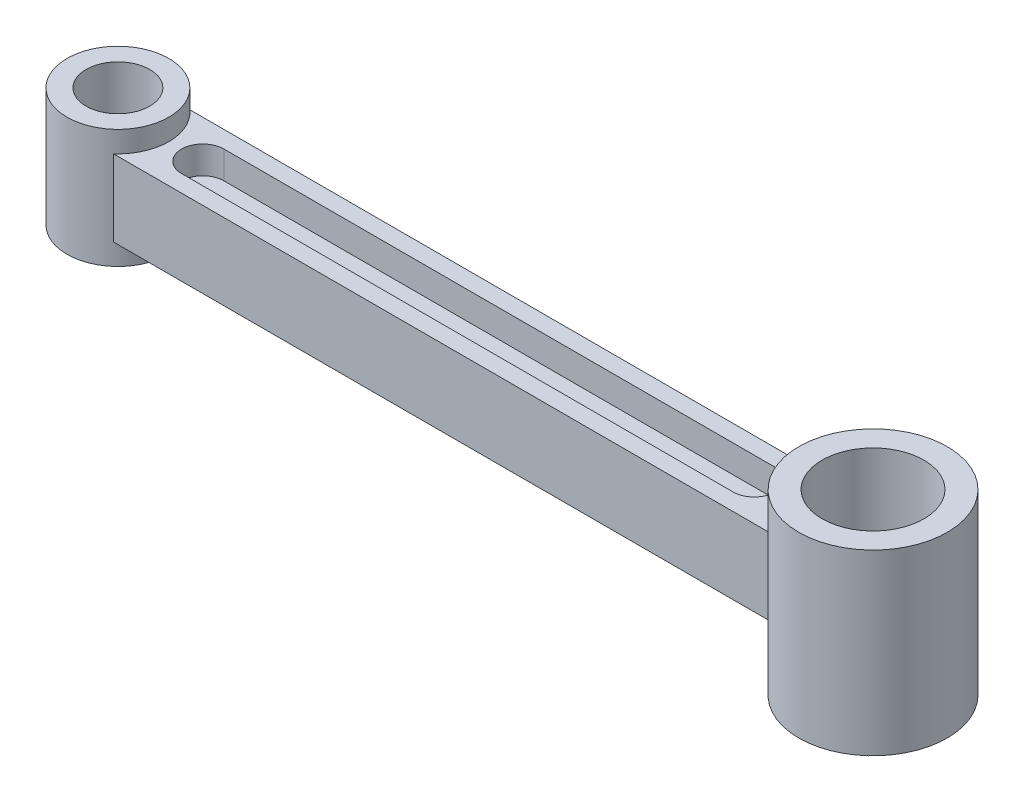
ISO-10303-21;
HEADER;
FILE_DESCRIPTION(('STEP AP214'),'2;1');
FILE_NAME('part.step','',(''),(''),'','','');
FILE_SCHEMA(('AUTOMOTIVE_DESIGN { 1 0 10303 214 1 1 1 1 }'));
ENDSEC;
DATA;
#1=APPLICATION_CONTEXT('core data for automotive mechanical design processes');
#2=APPLICATION_PROTOCOL_DEFINITION('international standard','automotive_design',2000,#1);
#3=PRODUCT_CONTEXT('',#1,'mechanical');
#4=PRODUCT('Part','Part','',(#3));
#5=PRODUCT_RELATED_PRODUCT_CATEGORY('part','',(#4));
#6=PRODUCT_DEFINITION_FORMATION('','',#4);
#7=PRODUCT_DEFINITION_CONTEXT('part definition',#1,'design');
#8=PRODUCT_DEFINITION('design','',#6,#7);
#9=PRODUCT_DEFINITION_SHAPE('','',#8);
#10=(LENGTH_UNIT() NAMED_UNIT(*) SI_UNIT(.MILLI.,.METRE.));
#11=(NAMED_UNIT(*) PLANE_ANGLE_UNIT() SI_UNIT($,.RADIAN.));
#12=(NAMED_UNIT(*) SI_UNIT($,.STERADIAN.) SOLID_ANGLE_UNIT());
#13=UNCERTAINTY_MEASURE_WITH_UNIT(LENGTH_MEASURE(1.E-05),#10,'distance_accuracy_value','');
#14=(GEOMETRIC_REPRESENTATION_CONTEXT(3) GLOBAL_UNCERTAINTY_ASSIGNED_CONTEXT((#13)) GLOBAL_UNIT_ASSIGNED_CONTEXT((#10,
#11,#12)) REPRESENTATION_CONTEXT('',''));
#15=CARTESIAN_POINT('',(0.,0.,0.));
#16=DIRECTION('',(0.,0.,1.));
#17=DIRECTION('',(1.,0.,0.));
#18=AXIS2_PLACEMENT_3D('',#15,#16,#17);
#19=CARTESIAN_POINT('',(0.,-9.,0.));
#20=DIRECTION('',(0.,1.,0.));
#21=DIRECTION('',(0.,0.,1.));
#22=AXIS2_PLACEMENT_3D('',#19,#20,#21);
#23=PLANE('',#22);
#24=CARTESIAN_POINT('',(0.,-9.,0.));
#25=DIRECTION('',(0.,-1.,0.));
#26=DIRECTION('',(0.,0.,1.));
#27=AXIS2_PLACEMENT_3D('',#24,#25,#26);
#28=CIRCLE('',#27,12.);
#29=CARTESIAN_POINT('',(7.93725393319378,-9.,-9.));
#30=VERTEX_POINT('',#29);
#31=CARTESIAN_POINT('',(7.93725393319378,-9.,9.));
#32=VERTEX_POINT('',#31);
#33=EDGE_CURVE('E235',#30,#32,#28,.T.);
#34=ORIENTED_EDGE('',*,*,#33,.F.);
#35=DIRECTION('',(-1.,0.,0.));
#36=VECTOR('',#35,1.);
#37=CARTESIAN_POINT('',(7.93725393319378,-9.,-9.));
#38=LINE('',#37,#36);
#39=CARTESIAN_POINT('',(162.991668980196,-9.,-9.));
#40=VERTEX_POINT('',#39);
#41=EDGE_CURVE('E244',#40,#30,#38,.T.);
#42=ORIENTED_EDGE('',*,*,#41,.F.);
#43=CARTESIAN_POINT('',(178.,-9.,0.));
#44=DIRECTION('',(0.,-1.,0.));
#45=DIRECTION('',(0.,0.,1.));
#46=AXIS2_PLACEMENT_3D('',#43,#44,#45);
#47=CIRCLE('',#46,17.5);
#48=CARTESIAN_POINT('',(162.991668980196,-9.,9.));
#49=VERTEX_POINT('',#48);
#50=EDGE_CURVE('E260',#49,#40,#47,.T.);
#51=ORIENTED_EDGE('',*,*,#50,.F.);
#52=DIRECTION('',(1.,0.,0.));
#53=VECTOR('',#52,1.);
#54=CARTESIAN_POINT('',(7.93725393319378,-9.,9.));
#55=LINE('',#54,#53);
#56=EDGE_CURVE('E257',#32,#49,#55,.T.);
#57=ORIENTED_EDGE('',*,*,#56,.F.);
#58=EDGE_LOOP('',(#34,#42,#51,#57));
#59=FACE_BOUND('',#58,.T.);
#60=CARTESIAN_POINT('',(20.,-9.,0.));
#61=DIRECTION('',(0.,1.,0.));
#62=DIRECTION('',(0.,0.,1.));
#63=AXIS2_PLACEMENT_3D('',#60,#61,#62);
#64=CIRCLE('',#63,5.);
#65=CARTESIAN_POINT('',(20.,-9.,-5.));
#66=VERTEX_POINT('',#65);
#67=CARTESIAN_POINT('',(20.,-9.,5.));
#68=VERTEX_POINT('',#67);
#69=EDGE_CURVE('E57',#66,#68,#64,.T.);
#70=ORIENTED_EDGE('',*,*,#69,.T.);
#71=DIRECTION('',(1.,0.,0.));
#72=VECTOR('',#71,1.);
#73=CARTESIAN_POINT('',(20.,-9.,5.));
#74=LINE('',#73,#72);
#75=CARTESIAN_POINT('',(150.,-9.,4.99999999999992));
#76=VERTEX_POINT('',#75);
#77=EDGE_CURVE('E149',#68,#76,#74,.T.);
#78=ORIENTED_EDGE('',*,*,#77,.T.);
#79=CARTESIAN_POINT('',(150.,-9.,0.));
#80=DIRECTION('',(0.,1.,0.));
#81=DIRECTION('',(0.,0.,1.));
#82=AXIS2_PLACEMENT_3D('',#79,#80,#81);
#83=CIRCLE('',#82,4.99999999999996);
#84=CARTESIAN_POINT('',(150.,-9.,-5.));
#85=VERTEX_POINT('',#84);
#86=EDGE_CURVE('E166',#76,#85,#83,.T.);
#87=ORIENTED_EDGE('',*,*,#86,.T.);
#88=DIRECTION('',(1.,0.,0.));
#89=VECTOR('',#88,1.);
#90=CARTESIAN_POINT('',(20.,-9.,-5.));
#91=LINE('',#90,#89);
#92=EDGE_CURVE('E163',#66,#85,#91,.T.);
#93=ORIENTED_EDGE('',*,*,#92,.F.);
#94=EDGE_LOOP('',(#70,#78,#87,#93));
#95=FACE_BOUND('',#94,.T.);
#96=ADVANCED_FACE('F41',(#59,#95),#23,.F.);
#97=CARTESIAN_POINT('',(0.,14.,0.));
#98=DIRECTION('',(0.,1.,0.));
#99=DIRECTION('',(0.,0.,1.));
#100=AXIS2_PLACEMENT_3D('',#97,#98,#99);
#101=PLANE('',#100);
#102=CARTESIAN_POINT('',(0.,14.,0.));
#103=DIRECTION('',(0.,1.,0.));
#104=DIRECTION('',(0.,0.,1.));
#105=AXIS2_PLACEMENT_3D('',#102,#103,#104);
#106=CIRCLE('',#105,12.);
#107=CARTESIAN_POINT('',(0.,14.,12.));
#108=VERTEX_POINT('',#107);
#109=EDGE_CURVE('E11',#108,#108,#106,.T.);
#110=ORIENTED_EDGE('',*,*,#109,.T.);
#111=EDGE_LOOP('',(#110));
#112=FACE_BOUND('',#111,.T.);
#113=CARTESIAN_POINT('',(0.,14.,0.));
#114=DIRECTION('',(0.,1.,0.));
#115=DIRECTION('',(0.,0.,1.));
#116=AXIS2_PLACEMENT_3D('',#113,#114,#115);
#117=CIRCLE('',#116,7.5);
#118=CARTESIAN_POINT('',(0.,14.,7.5));
#119=VERTEX_POINT('',#118);
#120=EDGE_CURVE('E282',#119,#119,#117,.T.);
#121=ORIENTED_EDGE('',*,*,#120,.F.);
#122=EDGE_LOOP('',(#121));
#123=FACE_BOUND('',#122,.T.);
#124=ADVANCED_FACE('F307',(#112,#123),#101,.T.);
#125=CARTESIAN_POINT('',(0.,-14.,0.));
#126=DIRECTION('',(0.,1.,0.));
#127=DIRECTION('',(0.,0.,1.));
#128=AXIS2_PLACEMENT_3D('',#125,#126,#127);
#129=PLANE('',#128);
#130=CARTESIAN_POINT('',(0.,-14.,0.));
#131=DIRECTION('',(0.,1.,0.));
#132=DIRECTION('',(0.,0.,1.));
#133=AXIS2_PLACEMENT_3D('',#130,#131,#132);
#134=CIRCLE('',#133,12.);
#135=CARTESIAN_POINT('',(0.,-14.,12.));
#136=VERTEX_POINT('',#135);
#137=EDGE_CURVE('E45',#136,#136,#134,.T.);
#138=ORIENTED_EDGE('',*,*,#137,.F.);
#139=EDGE_LOOP('',(#138));
#140=FACE_BOUND('',#139,.T.);
#141=CARTESIAN_POINT('',(0.,-14.,0.));
#142=DIRECTION('',(0.,1.,0.));
#143=DIRECTION('',(0.,0.,1.));
#144=AXIS2_PLACEMENT_3D('',#141,#142,#143);
#145=CIRCLE('',#144,7.5);
#146=CARTESIAN_POINT('',(0.,-14.,7.5));
#147=VERTEX_POINT('',#146);
#148=EDGE_CURVE('E281',#147,#147,#145,.T.);
#149=ORIENTED_EDGE('',*,*,#148,.T.);
#150=EDGE_LOOP('',(#149));
#151=FACE_BOUND('',#150,.T.);
#152=ADVANCED_FACE('F290',(#140,#151),#129,.F.);
#153=CARTESIAN_POINT('',(0.,14.,0.));
#154=DIRECTION('',(0.,-1.,0.));
#155=DIRECTION('',(0.,0.,-1.));
#156=AXIS2_PLACEMENT_3D('',#153,#154,#155);
#157=CYLINDRICAL_SURFACE('',#156,12.);
#158=DIRECTION('',(0.,-1.,0.));
#159=VECTOR('',#158,1.);
#160=CARTESIAN_POINT('',(7.93725393319378,9.,9.));
#161=LINE('',#160,#159);
#162=CARTESIAN_POINT('',(7.93725393319378,9.,9.));
#163=VERTEX_POINT('',#162);
#164=EDGE_CURVE('E277',#163,#32,#161,.T.);
#165=ORIENTED_EDGE('',*,*,#164,.F.);
#166=CARTESIAN_POINT('',(0.,9.,0.));
#167=DIRECTION('',(0.,-1.,0.));
#168=DIRECTION('',(0.,0.,1.));
#169=AXIS2_PLACEMENT_3D('',#166,#167,#168);
#170=CIRCLE('',#169,12.);
#171=CARTESIAN_POINT('',(7.93725393319378,9.,-9.));
#172=VERTEX_POINT('',#171);
#173=EDGE_CURVE('E239',#172,#163,#170,.T.);
#174=ORIENTED_EDGE('',*,*,#173,.F.);
#175=DIRECTION('',(0.,-1.,0.));
#176=VECTOR('',#175,1.);
#177=CARTESIAN_POINT('',(7.93725393319378,9.,-9.));
#178=LINE('',#177,#176);
#179=EDGE_CURVE('E254',#172,#30,#178,.T.);
#180=ORIENTED_EDGE('',*,*,#179,.T.);
#181=ORIENTED_EDGE('',*,*,#33,.T.);
#182=EDGE_LOOP('',(#165,#174,#180,#181));
#183=FACE_BOUND('',#182,.T.);
#184=ORIENTED_EDGE('',*,*,#109,.F.);
#185=EDGE_LOOP('',(#184));
#186=FACE_BOUND('',#185,.T.);
#187=ORIENTED_EDGE('',*,*,#137,.T.);
#188=EDGE_LOOP('',(#187));
#189=FACE_BOUND('',#188,.T.);
#190=ADVANCED_FACE('F43',(#183,#186,#189),#157,.T.);
#191=CARTESIAN_POINT('',(0.,14.,0.));
#192=DIRECTION('',(0.,-1.,0.));
#193=DIRECTION('',(0.,0.,-1.));
#194=AXIS2_PLACEMENT_3D('',#191,#192,#193);
#195=CYLINDRICAL_SURFACE('',#194,7.5);
#196=ORIENTED_EDGE('',*,*,#120,.T.);
#197=EDGE_LOOP('',(#196));
#198=FACE_BOUND('',#197,.T.);
#199=ORIENTED_EDGE('',*,*,#148,.F.);
#200=EDGE_LOOP('',(#199));
#201=FACE_BOUND('',#200,.T.);
#202=ADVANCED_FACE('F292',(#198,#201),#195,.F.);
#203=CARTESIAN_POINT('',(7.93725393319378,9.,9.));
#204=DIRECTION('',(0.,0.,-1.));
#205=DIRECTION('',(-1.,0.,0.));
#206=AXIS2_PLACEMENT_3D('',#203,#204,#205);
#207=PLANE('',#206);
#208=ORIENTED_EDGE('',*,*,#56,.T.);
#209=DIRECTION('',(0.,-1.,0.));
#210=VECTOR('',#209,1.);
#211=CARTESIAN_POINT('',(162.991668980196,9.,9.));
#212=LINE('',#211,#210);
#213=CARTESIAN_POINT('',(162.991668980196,9.,9.));
#214=VERTEX_POINT('',#213);
#215=EDGE_CURVE('E273',#214,#49,#212,.T.);
#216=ORIENTED_EDGE('',*,*,#215,.F.);
#217=DIRECTION('',(1.,0.,0.));
#218=VECTOR('',#217,1.);
#219=CARTESIAN_POINT('',(7.93725393319378,9.,9.));
#220=LINE('',#219,#218);
#221=EDGE_CURVE('E243',#163,#214,#220,.T.);
#222=ORIENTED_EDGE('',*,*,#221,.F.);
#223=ORIENTED_EDGE('',*,*,#164,.T.);
#224=EDGE_LOOP('',(#208,#216,#222,#223));
#225=FACE_BOUND('',#224,.T.);
#226=ADVANCED_FACE('F294',(#225),#207,.F.);
#227=CARTESIAN_POINT('',(7.93725393319378,9.,-9.));
#228=DIRECTION('',(0.,0.,1.));
#229=DIRECTION('',(1.,0.,0.));
#230=AXIS2_PLACEMENT_3D('',#227,#228,#229);
#231=PLANE('',#230);
#232=ORIENTED_EDGE('',*,*,#41,.T.);
#233=ORIENTED_EDGE('',*,*,#179,.F.);
#234=DIRECTION('',(-1.,0.,0.));
#235=VECTOR('',#234,1.);
#236=CARTESIAN_POINT('',(7.93725393319378,9.,-9.));
#237=LINE('',#236,#235);
#238=CARTESIAN_POINT('',(162.991668980196,9.,-9.));
#239=VERTEX_POINT('',#238);
#240=EDGE_CURVE('E250',#239,#172,#237,.T.);
#241=ORIENTED_EDGE('',*,*,#240,.F.);
#242=DIRECTION('',(0.,-1.,0.));
#243=VECTOR('',#242,1.);
#244=CARTESIAN_POINT('',(162.991668980196,9.,-9.));
#245=LINE('',#244,#243);
#246=EDGE_CURVE('E269',#239,#40,#245,.T.);
#247=ORIENTED_EDGE('',*,*,#246,.T.);
#248=EDGE_LOOP('',(#232,#233,#241,#247));
#249=FACE_BOUND('',#248,.T.);
#250=ADVANCED_FACE('F301',(#249),#231,.F.);
#251=CARTESIAN_POINT('',(0.,9.,0.));
#252=DIRECTION('',(0.,1.,0.));
#253=DIRECTION('',(0.,0.,1.));
#254=AXIS2_PLACEMENT_3D('',#251,#252,#253);
#255=PLANE('',#254);
#256=CARTESIAN_POINT('',(20.,9.,0.));
#257=DIRECTION('',(0.,1.,0.));
#258=DIRECTION('',(0.,0.,1.));
#259=AXIS2_PLACEMENT_3D('',#256,#257,#258);
#260=CIRCLE('',#259,5.);
#261=CARTESIAN_POINT('',(20.,9.,-5.));
#262=VERTEX_POINT('',#261);
#263=CARTESIAN_POINT('',(20.,9.,5.));
#264=VERTEX_POINT('',#263);
#265=EDGE_CURVE('E65',#262,#264,#260,.T.);
#266=ORIENTED_EDGE('',*,*,#265,.F.);
#267=DIRECTION('',(1.,0.,0.));
#268=VECTOR('',#267,1.);
#269=CARTESIAN_POINT('',(20.,9.,-5.));
#270=LINE('',#269,#268);
#271=CARTESIAN_POINT('',(150.,9.,-5.));
#272=VERTEX_POINT('',#271);
#273=EDGE_CURVE('E186',#262,#272,#270,.T.);
#274=ORIENTED_EDGE('',*,*,#273,.T.);
#275=CARTESIAN_POINT('',(150.,9.,0.));
#276=DIRECTION('',(0.,1.,0.));
#277=DIRECTION('',(0.,0.,1.));
#278=AXIS2_PLACEMENT_3D('',#275,#276,#277);
#279=CIRCLE('',#278,4.99999999999996);
#280=CARTESIAN_POINT('',(150.,9.,4.99999999999992));
#281=VERTEX_POINT('',#280);
#282=EDGE_CURVE('E204',#281,#272,#279,.T.);
#283=ORIENTED_EDGE('',*,*,#282,.F.);
#284=DIRECTION('',(1.,0.,0.));
#285=VECTOR('',#284,1.);
#286=CARTESIAN_POINT('',(20.,9.,5.));
#287=LINE('',#286,#285);
#288=EDGE_CURVE('E200',#264,#281,#287,.T.);
#289=ORIENTED_EDGE('',*,*,#288,.F.);
#290=EDGE_LOOP('',(#266,#274,#283,#289));
#291=FACE_BOUND('',#290,.T.);
#292=ORIENTED_EDGE('',*,*,#173,.T.);
#293=ORIENTED_EDGE('',*,*,#221,.T.);
#294=CARTESIAN_POINT('',(178.,9.,0.));
#295=DIRECTION('',(0.,-1.,0.));
#296=DIRECTION('',(0.,0.,1.));
#297=AXIS2_PLACEMENT_3D('',#294,#295,#296);
#298=CIRCLE('',#297,17.5);
#299=EDGE_CURVE('E247',#214,#239,#298,.T.);
#300=ORIENTED_EDGE('',*,*,#299,.T.);
#301=ORIENTED_EDGE('',*,*,#240,.T.);
#302=EDGE_LOOP('',(#292,#293,#300,#301));
#303=FACE_BOUND('',#302,.T.);
#304=ADVANCED_FACE('F318',(#291,#303),#255,.T.);
#305=CARTESIAN_POINT('',(178.,21.,0.));
#306=DIRECTION('',(0.,1.,0.));
#307=DIRECTION('',(0.,0.,1.));
#308=AXIS2_PLACEMENT_3D('',#305,#306,#307);
#309=PLANE('',#308);
#310=CARTESIAN_POINT('',(178.,21.,0.));
#311=DIRECTION('',(0.,1.,0.));
#312=DIRECTION('',(0.,0.,1.));
#313=AXIS2_PLACEMENT_3D('',#310,#311,#312);
#314=CIRCLE('',#313,17.5);
#315=CARTESIAN_POINT('',(178.,21.,17.5));
#316=VERTEX_POINT('',#315);
#317=EDGE_CURVE('E231',#316,#316,#314,.T.);
#318=ORIENTED_EDGE('',*,*,#317,.T.);
#319=EDGE_LOOP('',(#318));
#320=FACE_BOUND('',#319,.T.);
#321=CARTESIAN_POINT('',(178.,21.,0.));
#322=DIRECTION('',(0.,1.,0.));
#323=DIRECTION('',(0.,0.,1.));
#324=AXIS2_PLACEMENT_3D('',#321,#322,#323);
#325=CIRCLE('',#324,12.);
#326=CARTESIAN_POINT('',(178.,21.,12.));
#327=VERTEX_POINT('',#326);
#328=EDGE_CURVE('E223',#327,#327,#325,.T.);
#329=ORIENTED_EDGE('',*,*,#328,.F.);
#330=EDGE_LOOP('',(#329));
#331=FACE_BOUND('',#330,.T.);
#332=ADVANCED_FACE('F325',(#320,#331),#309,.T.);
#333=CARTESIAN_POINT('',(178.,-21.,0.));
#334=DIRECTION('',(0.,1.,0.));
#335=DIRECTION('',(0.,0.,1.));
#336=AXIS2_PLACEMENT_3D('',#333,#334,#335);
#337=PLANE('',#336);
#338=CARTESIAN_POINT('',(178.,-21.,0.));
#339=DIRECTION('',(0.,1.,0.));
#340=DIRECTION('',(0.,0.,1.));
#341=AXIS2_PLACEMENT_3D('',#338,#339,#340);
#342=CIRCLE('',#341,17.5);
#343=CARTESIAN_POINT('',(178.,-21.,17.5));
#344=VERTEX_POINT('',#343);
#345=EDGE_CURVE('E227',#344,#344,#342,.T.);
#346=ORIENTED_EDGE('',*,*,#345,.F.);
#347=EDGE_LOOP('',(#346));
#348=FACE_BOUND('',#347,.T.);
#349=CARTESIAN_POINT('',(178.,-21.,0.));
#350=DIRECTION('',(0.,1.,0.));
#351=DIRECTION('',(0.,0.,1.));
#352=AXIS2_PLACEMENT_3D('',#349,#350,#351);
#353=CIRCLE('',#352,12.);
#354=CARTESIAN_POINT('',(178.,-21.,12.));
#355=VERTEX_POINT('',#354);
#356=EDGE_CURVE('E214',#355,#355,#353,.T.);
#357=ORIENTED_EDGE('',*,*,#356,.T.);
#358=EDGE_LOOP('',(#357));
#359=FACE_BOUND('',#358,.T.);
#360=ADVANCED_FACE('F342',(#348,#359),#337,.F.);
#361=CARTESIAN_POINT('',(178.,21.,0.));
#362=DIRECTION('',(0.,-1.,0.));
#363=DIRECTION('',(0.,0.,-1.));
#364=AXIS2_PLACEMENT_3D('',#361,#362,#363);
#365=CYLINDRICAL_SURFACE('',#364,17.5);
#366=ORIENTED_EDGE('',*,*,#299,.F.);
#367=ORIENTED_EDGE('',*,*,#215,.T.);
#368=ORIENTED_EDGE('',*,*,#50,.T.);
#369=ORIENTED_EDGE('',*,*,#246,.F.);
#370=EDGE_LOOP('',(#366,#367,#368,#369));
#371=FACE_BOUND('',#370,.T.);
#372=ORIENTED_EDGE('',*,*,#317,.F.);
#373=EDGE_LOOP('',(#372));
#374=FACE_BOUND('',#373,.T.);
#375=ORIENTED_EDGE('',*,*,#345,.T.);
#376=EDGE_LOOP('',(#375));
#377=FACE_BOUND('',#376,.T.);
#378=ADVANCED_FACE('F337',(#371,#374,#377),#365,.T.);
#379=CARTESIAN_POINT('',(178.,21.,0.));
#380=DIRECTION('',(0.,-1.,0.));
#381=DIRECTION('',(0.,0.,-1.));
#382=AXIS2_PLACEMENT_3D('',#379,#380,#381);
#383=CYLINDRICAL_SURFACE('',#382,12.);
#384=ORIENTED_EDGE('',*,*,#328,.T.);
#385=EDGE_LOOP('',(#384));
#386=FACE_BOUND('',#385,.T.);
#387=ORIENTED_EDGE('',*,*,#356,.F.);
#388=EDGE_LOOP('',(#387));
#389=FACE_BOUND('',#388,.T.);
#390=ADVANCED_FACE('F341',(#386,#389),#383,.F.);
#391=CARTESIAN_POINT('',(20.,2.5,0.));
#392=DIRECTION('',(0.,1.,0.));
#393=DIRECTION('',(0.,0.,1.));
#394=AXIS2_PLACEMENT_3D('',#391,#392,#393);
#395=CYLINDRICAL_SURFACE('',#394,5.);
#396=ORIENTED_EDGE('',*,*,#265,.T.);
#397=DIRECTION('',(0.,1.,0.));
#398=VECTOR('',#397,1.);
#399=CARTESIAN_POINT('',(20.,2.5,5.));
#400=LINE('',#399,#398);
#401=CARTESIAN_POINT('',(20.,2.5,5.));
#402=VERTEX_POINT('',#401);
#403=EDGE_CURVE('E197',#402,#264,#400,.T.);
#404=ORIENTED_EDGE('',*,*,#403,.F.);
#405=CARTESIAN_POINT('',(20.,2.5,0.));
#406=DIRECTION('',(0.,1.,0.));
#407=DIRECTION('',(0.,0.,1.));
#408=AXIS2_PLACEMENT_3D('',#405,#406,#407);
#409=CIRCLE('',#408,5.);
#410=CARTESIAN_POINT('',(20.,2.5,-5.));
#411=VERTEX_POINT('',#410);
#412=EDGE_CURVE('E181',#411,#402,#409,.T.);
#413=ORIENTED_EDGE('',*,*,#412,.F.);
#414=DIRECTION('',(0.,1.,0.));
#415=VECTOR('',#414,1.);
#416=CARTESIAN_POINT('',(20.,2.5,-5.));
#417=LINE('',#416,#415);
#418=EDGE_CURVE('E211',#411,#262,#417,.T.);
#419=ORIENTED_EDGE('',*,*,#418,.T.);
#420=EDGE_LOOP('',(#396,#404,#413,#419));
#421=FACE_BOUND('',#420,.T.);
#422=ADVANCED_FACE('F353',(#421),#395,.F.);
#423=CARTESIAN_POINT('',(20.,2.5,-5.));
#424=DIRECTION('',(0.,0.,1.));
#425=DIRECTION('',(1.,0.,0.));
#426=AXIS2_PLACEMENT_3D('',#423,#424,#425);
#427=PLANE('',#426);
#428=ORIENTED_EDGE('',*,*,#273,.F.);
#429=ORIENTED_EDGE('',*,*,#418,.F.);
#430=DIRECTION('',(1.,0.,0.));
#431=VECTOR('',#430,1.);
#432=CARTESIAN_POINT('',(20.,2.5,-5.));
#433=LINE('',#432,#431);
#434=CARTESIAN_POINT('',(150.,2.5,-5.));
#435=VERTEX_POINT('',#434);
#436=EDGE_CURVE('E194',#411,#435,#433,.T.);
#437=ORIENTED_EDGE('',*,*,#436,.T.);
#438=DIRECTION('',(0.,1.,0.));
#439=VECTOR('',#438,1.);
#440=CARTESIAN_POINT('',(150.,2.5,-5.));
#441=LINE('',#440,#439);
#442=EDGE_CURVE('E215',#435,#272,#441,.T.);
#443=ORIENTED_EDGE('',*,*,#442,.T.);
#444=EDGE_LOOP('',(#428,#429,#437,#443));
#445=FACE_BOUND('',#444,.T.);
#446=ADVANCED_FACE('F359',(#445),#427,.T.);
#447=CARTESIAN_POINT('',(150.,2.5,0.));
#448=DIRECTION('',(0.,1.,0.));
#449=DIRECTION('',(0.,0.,1.));
#450=AXIS2_PLACEMENT_3D('',#447,#448,#449);
#451=CYLINDRICAL_SURFACE('',#450,4.99999999999996);
#452=ORIENTED_EDGE('',*,*,#282,.T.);
#453=ORIENTED_EDGE('',*,*,#442,.F.);
#454=CARTESIAN_POINT('',(150.,2.5,0.));
#455=DIRECTION('',(0.,1.,0.));
#456=DIRECTION('',(0.,0.,1.));
#457=AXIS2_PLACEMENT_3D('',#454,#455,#456);
#458=CIRCLE('',#457,4.99999999999996);
#459=CARTESIAN_POINT('',(150.,2.5,4.99999999999992));
#460=VERTEX_POINT('',#459);
#461=EDGE_CURVE('E190',#460,#435,#458,.T.);
#462=ORIENTED_EDGE('',*,*,#461,.F.);
#463=DIRECTION('',(0.,1.,0.));
#464=VECTOR('',#463,1.);
#465=CARTESIAN_POINT('',(150.,2.5,4.99999999999992));
#466=LINE('',#465,#464);
#467=EDGE_CURVE('E218',#460,#281,#466,.T.);
#468=ORIENTED_EDGE('',*,*,#467,.T.);
#469=EDGE_LOOP('',(#452,#453,#462,#468));
#470=FACE_BOUND('',#469,.T.);
#471=ADVANCED_FACE('F404',(#470),#451,.F.);
#472=CARTESIAN_POINT('',(20.,2.5,5.));
#473=DIRECTION('',(0.,0.,1.));
#474=DIRECTION('',(1.,0.,0.));
#475=AXIS2_PLACEMENT_3D('',#472,#473,#474);
#476=PLANE('',#475);
#477=ORIENTED_EDGE('',*,*,#288,.T.);
#478=ORIENTED_EDGE('',*,*,#467,.F.);
#479=DIRECTION('',(1.,0.,0.));
#480=VECTOR('',#479,1.);
#481=CARTESIAN_POINT('',(20.,2.5,5.));
#482=LINE('',#481,#480);
#483=EDGE_CURVE('E185',#402,#460,#482,.T.);
#484=ORIENTED_EDGE('',*,*,#483,.F.);
#485=ORIENTED_EDGE('',*,*,#403,.T.);
#486=EDGE_LOOP('',(#477,#478,#484,#485));
#487=FACE_BOUND('',#486,.T.);
#488=ADVANCED_FACE('F414',(#487),#476,.F.);
#489=CARTESIAN_POINT('',(20.,2.5,0.));
#490=DIRECTION('',(0.,1.,0.));
#491=DIRECTION('',(0.,0.,1.));
#492=AXIS2_PLACEMENT_3D('',#489,#490,#491);
#493=PLANE('',#492);
#494=ORIENTED_EDGE('',*,*,#412,.T.);
#495=ORIENTED_EDGE('',*,*,#483,.T.);
#496=ORIENTED_EDGE('',*,*,#461,.T.);
#497=ORIENTED_EDGE('',*,*,#436,.F.);
#498=EDGE_LOOP('',(#494,#495,#496,#497));
#499=FACE_BOUND('',#498,.T.);
#500=ADVANCED_FACE('F424',(#499),#493,.T.);
#501=CARTESIAN_POINT('',(20.,-2.5,0.));
#502=DIRECTION('',(0.,-1.,0.));
#503=DIRECTION('',(0.,0.,-1.));
#504=AXIS2_PLACEMENT_3D('',#501,#502,#503);
#505=CYLINDRICAL_SURFACE('',#504,5.);
#506=ORIENTED_EDGE('',*,*,#69,.F.);
#507=DIRECTION('',(0.,-1.,0.));
#508=VECTOR('',#507,1.);
#509=CARTESIAN_POINT('',(20.,-2.5,-5.));
#510=LINE('',#509,#508);
#511=CARTESIAN_POINT('',(20.,-2.5,-5.));
#512=VERTEX_POINT('',#511);
#513=EDGE_CURVE('E130',#512,#66,#510,.T.);
#514=ORIENTED_EDGE('',*,*,#513,.F.);
#515=CARTESIAN_POINT('',(20.,-2.5,0.));
#516=DIRECTION('',(0.,1.,0.));
#517=DIRECTION('',(0.,0.,1.));
#518=AXIS2_PLACEMENT_3D('',#515,#516,#517);
#519=CIRCLE('',#518,5.);
#520=CARTESIAN_POINT('',(20.,-2.5,5.));
#521=VERTEX_POINT('',#520);
#522=EDGE_CURVE('E133',#512,#521,#519,.T.);
#523=ORIENTED_EDGE('',*,*,#522,.T.);
#524=DIRECTION('',(0.,-1.,0.));
#525=VECTOR('',#524,1.);
#526=CARTESIAN_POINT('',(20.,-2.5,5.));
#527=LINE('',#526,#525);
#528=EDGE_CURVE('E173',#521,#68,#527,.T.);
#529=ORIENTED_EDGE('',*,*,#528,.T.);
#530=EDGE_LOOP('',(#506,#514,#523,#529));
#531=FACE_BOUND('',#530,.T.);
#532=ADVANCED_FACE('F132',(#531),#505,.F.);
#533=CARTESIAN_POINT('',(20.,-2.5,5.));
#534=DIRECTION('',(0.,0.,-1.));
#535=DIRECTION('',(-1.,0.,0.));
#536=AXIS2_PLACEMENT_3D('',#533,#534,#535);
#537=PLANE('',#536);
#538=ORIENTED_EDGE('',*,*,#77,.F.);
#539=ORIENTED_EDGE('',*,*,#528,.F.);
#540=DIRECTION('',(1.,0.,0.));
#541=VECTOR('',#540,1.);
#542=CARTESIAN_POINT('',(20.,-2.5,5.));
#543=LINE('',#542,#541);
#544=CARTESIAN_POINT('',(150.,-2.5,4.99999999999992));
#545=VERTEX_POINT('',#544);
#546=EDGE_CURVE('E141',#521,#545,#543,.T.);
#547=ORIENTED_EDGE('',*,*,#546,.T.);
#548=DIRECTION('',(0.,-1.,0.));
#549=VECTOR('',#548,1.);
#550=CARTESIAN_POINT('',(150.,-2.5,4.99999999999992));
#551=LINE('',#550,#549);
#552=EDGE_CURVE('E176',#545,#76,#551,.T.);
#553=ORIENTED_EDGE('',*,*,#552,.T.);
#554=EDGE_LOOP('',(#538,#539,#547,#553));
#555=FACE_BOUND('',#554,.T.);
#556=ADVANCED_FACE('F446',(#555),#537,.T.);
#557=CARTESIAN_POINT('',(150.,-2.5,0.));
#558=DIRECTION('',(0.,-1.,0.));
#559=DIRECTION('',(0.,0.,-1.));
#560=AXIS2_PLACEMENT_3D('',#557,#558,#559);
#561=CYLINDRICAL_SURFACE('',#560,4.99999999999996);
#562=ORIENTED_EDGE('',*,*,#86,.F.);
#563=ORIENTED_EDGE('',*,*,#552,.F.);
#564=CARTESIAN_POINT('',(150.,-2.5,0.));
#565=DIRECTION('',(0.,1.,0.));
#566=DIRECTION('',(0.,0.,1.));
#567=AXIS2_PLACEMENT_3D('',#564,#565,#566);
#568=CIRCLE('',#567,4.99999999999996);
#569=CARTESIAN_POINT('',(150.,-2.5,-5.));
#570=VERTEX_POINT('',#569);
#571=EDGE_CURVE('E154',#545,#570,#568,.T.);
#572=ORIENTED_EDGE('',*,*,#571,.T.);
#573=DIRECTION('',(0.,-1.,0.));
#574=VECTOR('',#573,1.);
#575=CARTESIAN_POINT('',(150.,-2.5,-5.));
#576=LINE('',#575,#574);
#577=EDGE_CURVE('E140',#570,#85,#576,.T.);
#578=ORIENTED_EDGE('',*,*,#577,.T.);
#579=EDGE_LOOP('',(#562,#563,#572,#578));
#580=FACE_BOUND('',#579,.T.);
#581=ADVANCED_FACE('F455',(#580),#561,.F.);
#582=CARTESIAN_POINT('',(20.,-2.5,-5.));
#583=DIRECTION('',(0.,0.,-1.));
#584=DIRECTION('',(-1.,0.,0.));
#585=AXIS2_PLACEMENT_3D('',#582,#583,#584);
#586=PLANE('',#585);
#587=ORIENTED_EDGE('',*,*,#92,.T.);
#588=ORIENTED_EDGE('',*,*,#577,.F.);
#589=DIRECTION('',(1.,0.,0.));
#590=VECTOR('',#589,1.);
#591=CARTESIAN_POINT('',(20.,-2.5,-5.));
#592=LINE('',#591,#590);
#593=EDGE_CURVE('E147',#512,#570,#592,.T.);
#594=ORIENTED_EDGE('',*,*,#593,.F.);
#595=ORIENTED_EDGE('',*,*,#513,.T.);
#596=EDGE_LOOP('',(#587,#588,#594,#595));
#597=FACE_BOUND('',#596,.T.);
#598=ADVANCED_FACE('F152',(#597),#586,.F.);
#599=CARTESIAN_POINT('',(20.,-2.5,0.));
#600=DIRECTION('',(0.,-1.,0.));
#601=DIRECTION('',(0.,0.,1.));
#602=AXIS2_PLACEMENT_3D('',#599,#600,#601);
#603=PLANE('',#602);
#604=ORIENTED_EDGE('',*,*,#522,.F.);
#605=ORIENTED_EDGE('',*,*,#593,.T.);
#606=ORIENTED_EDGE('',*,*,#571,.F.);
#607=ORIENTED_EDGE('',*,*,#546,.F.);
#608=EDGE_LOOP('',(#604,#605,#606,#607));
#609=FACE_BOUND('',#608,.T.);
#610=ADVANCED_FACE('F145',(#609),#603,.T.);
#611=CLOSED_SHELL('',(#96,#124,#152,#190,#202,#226,#250,#304,#332,#360,#378,#390,#422,#446,#471,
#488,#500,#532,#556,#581,#598,#610));
#612=MANIFOLD_SOLID_BREP('B2',#611);
#613=ADVANCED_BREP_SHAPE_REPRESENTATION('',(#18,#612),#14);
#614=SHAPE_DEFINITION_REPRESENTATION(#9,#613);
ENDSEC;
END-ISO-10303-21;
